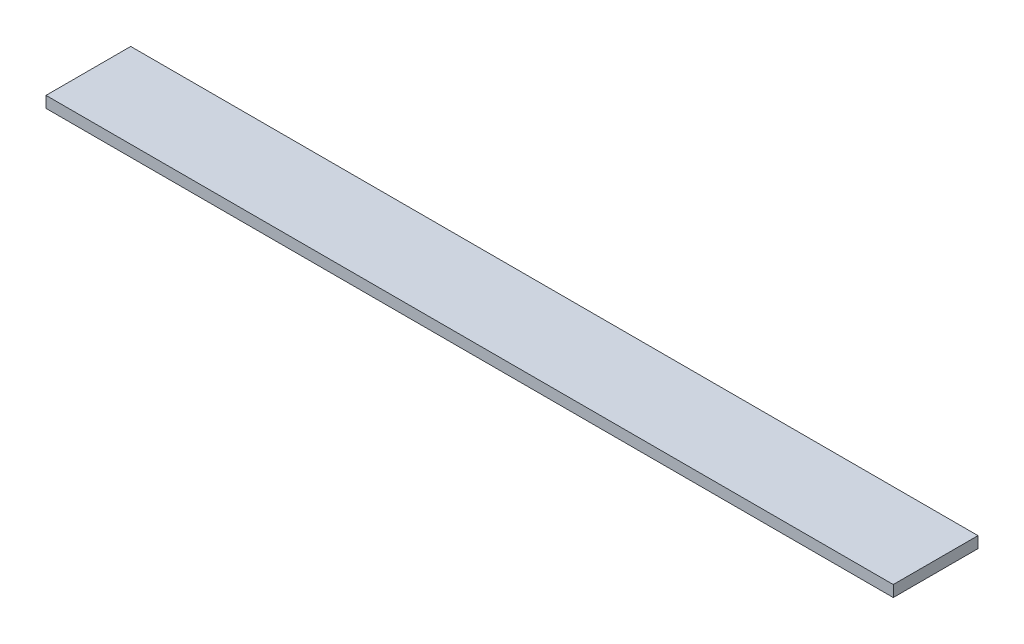
ISO-10303-21;
HEADER;
FILE_DESCRIPTION(('STEP AP214'),'2;1');
FILE_NAME('part.step','',(''),(''),'','','');
FILE_SCHEMA(('AUTOMOTIVE_DESIGN { 1 0 10303 214 1 1 1 1 }'));
ENDSEC;
DATA;
#1=APPLICATION_CONTEXT('core data for automotive mechanical design processes');
#2=APPLICATION_PROTOCOL_DEFINITION('international standard','automotive_design',2000,#1);
#3=PRODUCT_CONTEXT('',#1,'mechanical');
#4=PRODUCT('Part','Part','',(#3));
#5=PRODUCT_RELATED_PRODUCT_CATEGORY('part','',(#4));
#6=PRODUCT_DEFINITION_FORMATION('','',#4);
#7=PRODUCT_DEFINITION_CONTEXT('part definition',#1,'design');
#8=PRODUCT_DEFINITION('design','',#6,#7);
#9=PRODUCT_DEFINITION_SHAPE('','',#8);
#10=(LENGTH_UNIT() NAMED_UNIT(*) SI_UNIT(.MILLI.,.METRE.));
#11=(NAMED_UNIT(*) PLANE_ANGLE_UNIT() SI_UNIT($,.RADIAN.));
#12=(NAMED_UNIT(*) SI_UNIT($,.STERADIAN.) SOLID_ANGLE_UNIT());
#13=UNCERTAINTY_MEASURE_WITH_UNIT(LENGTH_MEASURE(1.E-05),#10,'distance_accuracy_value','');
#14=(GEOMETRIC_REPRESENTATION_CONTEXT(3) GLOBAL_UNCERTAINTY_ASSIGNED_CONTEXT((#13)) GLOBAL_UNIT_ASSIGNED_CONTEXT((#10,
#11,#12)) REPRESENTATION_CONTEXT('',''));
#15=CARTESIAN_POINT('',(0.,0.,0.));
#16=DIRECTION('',(0.,0.,1.));
#17=DIRECTION('',(1.,0.,0.));
#18=AXIS2_PLACEMENT_3D('',#15,#16,#17);
#19=CARTESIAN_POINT('',(300.,-2.,-15.));
#20=DIRECTION('',(0.,0.,1.));
#21=DIRECTION('',(1.,0.,0.));
#22=AXIS2_PLACEMENT_3D('',#19,#20,#21);
#23=PLANE('',#22);
#24=DIRECTION('',(0.,1.,0.));
#25=VECTOR('',#24,1.);
#26=CARTESIAN_POINT('',(0.,-2.,-15.));
#27=LINE('',#26,#25);
#28=CARTESIAN_POINT('',(0.,-2.,-15.));
#29=VERTEX_POINT('',#28);
#30=CARTESIAN_POINT('',(0.,2.,-15.));
#31=VERTEX_POINT('',#30);
#32=EDGE_CURVE('E98',#29,#31,#27,.T.);
#33=ORIENTED_EDGE('',*,*,#32,.T.);
#34=DIRECTION('',(-1.,0.,0.));
#35=VECTOR('',#34,1.);
#36=CARTESIAN_POINT('',(300.,2.,-15.));
#37=LINE('',#36,#35);
#38=CARTESIAN_POINT('',(300.,2.,-15.));
#39=VERTEX_POINT('',#38);
#40=EDGE_CURVE('E11',#39,#31,#37,.T.);
#41=ORIENTED_EDGE('',*,*,#40,.F.);
#42=DIRECTION('',(0.,1.,0.));
#43=VECTOR('',#42,1.);
#44=CARTESIAN_POINT('',(300.,-2.,-15.));
#45=LINE('',#44,#43);
#46=CARTESIAN_POINT('',(300.,-2.,-15.));
#47=VERTEX_POINT('',#46);
#48=EDGE_CURVE('E86',#47,#39,#45,.T.);
#49=ORIENTED_EDGE('',*,*,#48,.F.);
#50=DIRECTION('',(-1.,0.,0.));
#51=VECTOR('',#50,1.);
#52=CARTESIAN_POINT('',(300.,-2.,-15.));
#53=LINE('',#52,#51);
#54=EDGE_CURVE('E94',#47,#29,#53,.T.);
#55=ORIENTED_EDGE('',*,*,#54,.T.);
#56=EDGE_LOOP('',(#33,#41,#49,#55));
#57=FACE_BOUND('',#56,.T.);
#58=ADVANCED_FACE('F35',(#57),#23,.F.);
#59=CARTESIAN_POINT('',(300.,2.,15.));
#60=DIRECTION('',(0.,-1.,0.));
#61=DIRECTION('',(0.,0.,-1.));
#62=AXIS2_PLACEMENT_3D('',#59,#60,#61);
#63=PLANE('',#62);
#64=DIRECTION('',(0.,0.,1.));
#65=VECTOR('',#64,1.);
#66=CARTESIAN_POINT('',(0.,2.,15.));
#67=LINE('',#66,#65);
#68=CARTESIAN_POINT('',(0.,2.,15.));
#69=VERTEX_POINT('',#68);
#70=EDGE_CURVE('E90',#31,#69,#67,.T.);
#71=ORIENTED_EDGE('',*,*,#70,.T.);
#72=DIRECTION('',(-1.,0.,0.));
#73=VECTOR('',#72,1.);
#74=CARTESIAN_POINT('',(300.,2.,15.));
#75=LINE('',#74,#73);
#76=CARTESIAN_POINT('',(300.,2.,15.));
#77=VERTEX_POINT('',#76);
#78=EDGE_CURVE('E43',#77,#69,#75,.T.);
#79=ORIENTED_EDGE('',*,*,#78,.F.);
#80=DIRECTION('',(0.,0.,1.));
#81=VECTOR('',#80,1.);
#82=CARTESIAN_POINT('',(300.,2.,15.));
#83=LINE('',#82,#81);
#84=EDGE_CURVE('E81',#39,#77,#83,.T.);
#85=ORIENTED_EDGE('',*,*,#84,.F.);
#86=ORIENTED_EDGE('',*,*,#40,.T.);
#87=EDGE_LOOP('',(#71,#79,#85,#86));
#88=FACE_BOUND('',#87,.T.);
#89=ADVANCED_FACE('F89',(#88),#63,.F.);
#90=CARTESIAN_POINT('',(300.,-2.,15.));
#91=DIRECTION('',(0.,0.,-1.));
#92=DIRECTION('',(-1.,0.,0.));
#93=AXIS2_PLACEMENT_3D('',#90,#91,#92);
#94=PLANE('',#93);
#95=DIRECTION('',(0.,-1.,0.));
#96=VECTOR('',#95,1.);
#97=CARTESIAN_POINT('',(0.,-2.,15.));
#98=LINE('',#97,#96);
#99=CARTESIAN_POINT('',(0.,-2.,15.));
#100=VERTEX_POINT('',#99);
#101=EDGE_CURVE('E68',#69,#100,#98,.T.);
#102=ORIENTED_EDGE('',*,*,#101,.T.);
#103=DIRECTION('',(-1.,0.,0.));
#104=VECTOR('',#103,1.);
#105=CARTESIAN_POINT('',(300.,-2.,15.));
#106=LINE('',#105,#104);
#107=CARTESIAN_POINT('',(300.,-2.,15.));
#108=VERTEX_POINT('',#107);
#109=EDGE_CURVE('E91',#108,#100,#106,.T.);
#110=ORIENTED_EDGE('',*,*,#109,.F.);
#111=DIRECTION('',(0.,-1.,0.));
#112=VECTOR('',#111,1.);
#113=CARTESIAN_POINT('',(300.,-2.,15.));
#114=LINE('',#113,#112);
#115=EDGE_CURVE('E84',#77,#108,#114,.T.);
#116=ORIENTED_EDGE('',*,*,#115,.F.);
#117=ORIENTED_EDGE('',*,*,#78,.T.);
#118=EDGE_LOOP('',(#102,#110,#116,#117));
#119=FACE_BOUND('',#118,.T.);
#120=ADVANCED_FACE('F92',(#119),#94,.F.);
#121=CARTESIAN_POINT('',(300.,-2.,15.));
#122=DIRECTION('',(0.,1.,0.));
#123=DIRECTION('',(0.,0.,1.));
#124=AXIS2_PLACEMENT_3D('',#121,#122,#123);
#125=PLANE('',#124);
#126=DIRECTION('',(0.,0.,-1.));
#127=VECTOR('',#126,1.);
#128=CARTESIAN_POINT('',(0.,-2.,15.));
#129=LINE('',#128,#127);
#130=EDGE_CURVE('E74',#100,#29,#129,.T.);
#131=ORIENTED_EDGE('',*,*,#130,.T.);
#132=ORIENTED_EDGE('',*,*,#54,.F.);
#133=DIRECTION('',(0.,0.,-1.));
#134=VECTOR('',#133,1.);
#135=CARTESIAN_POINT('',(300.,-2.,15.));
#136=LINE('',#135,#134);
#137=EDGE_CURVE('E51',#108,#47,#136,.T.);
#138=ORIENTED_EDGE('',*,*,#137,.F.);
#139=ORIENTED_EDGE('',*,*,#109,.T.);
#140=EDGE_LOOP('',(#131,#132,#138,#139));
#141=FACE_BOUND('',#140,.T.);
#142=ADVANCED_FACE('F105',(#141),#125,.F.);
#143=CARTESIAN_POINT('',(300.,0.,0.));
#144=DIRECTION('',(-1.,0.,0.));
#145=DIRECTION('',(0.,0.,1.));
#146=AXIS2_PLACEMENT_3D('',#143,#144,#145);
#147=PLANE('',#146);
#148=ORIENTED_EDGE('',*,*,#48,.T.);
#149=ORIENTED_EDGE('',*,*,#84,.T.);
#150=ORIENTED_EDGE('',*,*,#115,.T.);
#151=ORIENTED_EDGE('',*,*,#137,.T.);
#152=EDGE_LOOP('',(#148,#149,#150,#151));
#153=FACE_BOUND('',#152,.T.);
#154=ADVANCED_FACE('F82',(#153),#147,.F.);
#155=CARTESIAN_POINT('',(0.,0.,0.));
#156=DIRECTION('',(-1.,0.,0.));
#157=DIRECTION('',(0.,0.,1.));
#158=AXIS2_PLACEMENT_3D('',#155,#156,#157);
#159=PLANE('',#158);
#160=ORIENTED_EDGE('',*,*,#32,.F.);
#161=ORIENTED_EDGE('',*,*,#130,.F.);
#162=ORIENTED_EDGE('',*,*,#101,.F.);
#163=ORIENTED_EDGE('',*,*,#70,.F.);
#164=EDGE_LOOP('',(#160,#161,#162,#163));
#165=FACE_BOUND('',#164,.T.);
#166=ADVANCED_FACE('F108',(#165),#159,.T.);
#167=CLOSED_SHELL('',(#58,#89,#120,#142,#154,#166));
#168=MANIFOLD_SOLID_BREP('B2',#167);
#169=ADVANCED_BREP_SHAPE_REPRESENTATION('',(#18,#168),#14);
#170=SHAPE_DEFINITION_REPRESENTATION(#9,#169);
ENDSEC;
END-ISO-10303-21;
